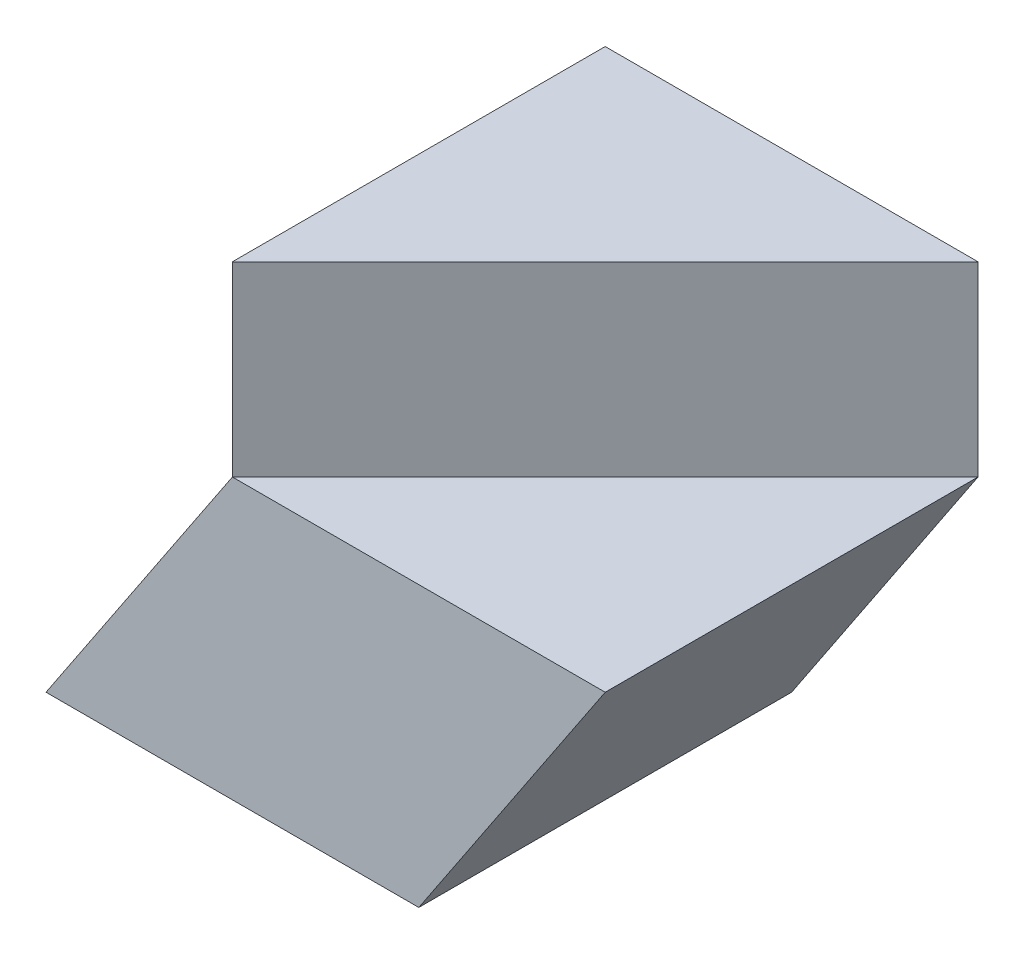
ISO-10303-21;
HEADER;
FILE_DESCRIPTION(('STEP AP214'),'2;1');
FILE_NAME('part.step','',(''),(''),'','','');
FILE_SCHEMA(('AUTOMOTIVE_DESIGN { 1 0 10303 214 1 1 1 1 }'));
ENDSEC;
DATA;
#1=APPLICATION_CONTEXT('core data for automotive mechanical design processes');
#2=APPLICATION_PROTOCOL_DEFINITION('international standard','automotive_design',2000,#1);
#3=PRODUCT_CONTEXT('',#1,'mechanical');
#4=PRODUCT('Part','Part','',(#3));
#5=PRODUCT_RELATED_PRODUCT_CATEGORY('part','',(#4));
#6=PRODUCT_DEFINITION_FORMATION('','',#4);
#7=PRODUCT_DEFINITION_CONTEXT('part definition',#1,'design');
#8=PRODUCT_DEFINITION('design','',#6,#7);
#9=PRODUCT_DEFINITION_SHAPE('','',#8);
#10=(LENGTH_UNIT() NAMED_UNIT(*) SI_UNIT(.MILLI.,.METRE.));
#11=(NAMED_UNIT(*) PLANE_ANGLE_UNIT() SI_UNIT($,.RADIAN.));
#12=(NAMED_UNIT(*) SI_UNIT($,.STERADIAN.) SOLID_ANGLE_UNIT());
#13=UNCERTAINTY_MEASURE_WITH_UNIT(LENGTH_MEASURE(1.E-05),#10,'distance_accuracy_value','');
#14=(GEOMETRIC_REPRESENTATION_CONTEXT(3) GLOBAL_UNCERTAINTY_ASSIGNED_CONTEXT((#13)) GLOBAL_UNIT_ASSIGNED_CONTEXT((#10,
#11,#12)) REPRESENTATION_CONTEXT('',''));
#15=CARTESIAN_POINT('',(0.,0.,0.));
#16=DIRECTION('',(0.,0.,1.));
#17=DIRECTION('',(1.,0.,0.));
#18=AXIS2_PLACEMENT_3D('',#15,#16,#17);
#19=CARTESIAN_POINT('',(0.,0.,40.));
#20=DIRECTION('',(0.,0.,1.));
#21=DIRECTION('',(1.,0.,0.));
#22=AXIS2_PLACEMENT_3D('',#19,#20,#21);
#23=PLANE('',#22);
#24=DIRECTION('',(-0.554700196225229,-0.832050294337844,0.));
#25=VECTOR('',#24,1.);
#26=CARTESIAN_POINT('',(27.6923076923077,-18.4615384615385,40.));
#27=LINE('',#26,#25);
#28=CARTESIAN_POINT('',(40.,0.,40.));
#29=VERTEX_POINT('',#28);
#30=CARTESIAN_POINT('',(20.,-30.,40.));
#31=VERTEX_POINT('',#30);
#32=EDGE_CURVE('E129',#29,#31,#27,.T.);
#33=ORIENTED_EDGE('',*,*,#32,.F.);
#34=DIRECTION('',(1.,0.,0.));
#35=VECTOR('',#34,1.);
#36=CARTESIAN_POINT('',(40.,0.,40.));
#37=LINE('',#36,#35);
#38=CARTESIAN_POINT('',(0.,0.,40.));
#39=VERTEX_POINT('',#38);
#40=EDGE_CURVE('E101',#39,#29,#37,.T.);
#41=ORIENTED_EDGE('',*,*,#40,.F.);
#42=DIRECTION('',(-0.554700196225229,-0.832050294337844,0.));
#43=VECTOR('',#42,1.);
#44=CARTESIAN_POINT('',(0.,0.,40.));
#45=LINE('',#44,#43);
#46=CARTESIAN_POINT('',(-20.,-30.,40.));
#47=VERTEX_POINT('',#46);
#48=EDGE_CURVE('E54',#39,#47,#45,.T.);
#49=ORIENTED_EDGE('',*,*,#48,.T.);
#50=DIRECTION('',(-1.,0.,0.));
#51=VECTOR('',#50,1.);
#52=CARTESIAN_POINT('',(0.,-30.,40.));
#53=LINE('',#52,#51);
#54=EDGE_CURVE('E83',#31,#47,#53,.T.);
#55=ORIENTED_EDGE('',*,*,#54,.F.);
#56=EDGE_LOOP('',(#33,#41,#49,#55));
#57=FACE_BOUND('',#56,.T.);
#58=ADVANCED_FACE('F37',(#57),#23,.T.);
#59=CARTESIAN_POINT('',(0.,-30.,40.));
#60=DIRECTION('',(0.,-1.,0.));
#61=DIRECTION('',(1.,0.,0.));
#62=AXIS2_PLACEMENT_3D('',#59,#60,#61);
#63=PLANE('',#62);
#64=DIRECTION('',(-1.,0.,0.));
#65=VECTOR('',#64,1.);
#66=CARTESIAN_POINT('',(0.,-30.,0.));
#67=LINE('',#66,#65);
#68=CARTESIAN_POINT('',(20.,-30.,0.));
#69=VERTEX_POINT('',#68);
#70=CARTESIAN_POINT('',(-20.,-30.,0.));
#71=VERTEX_POINT('',#70);
#72=EDGE_CURVE('E81',#69,#71,#67,.T.);
#73=ORIENTED_EDGE('',*,*,#72,.F.);
#74=DIRECTION('',(0.,0.,-1.));
#75=VECTOR('',#74,1.);
#76=CARTESIAN_POINT('',(20.,-30.,40.));
#77=LINE('',#76,#75);
#78=EDGE_CURVE('E11',#31,#69,#77,.T.);
#79=ORIENTED_EDGE('',*,*,#78,.F.);
#80=ORIENTED_EDGE('',*,*,#54,.T.);
#81=DIRECTION('',(0.,0.,-1.));
#82=VECTOR('',#81,1.);
#83=CARTESIAN_POINT('',(-20.,-30.,40.));
#84=LINE('',#83,#82);
#85=EDGE_CURVE('E79',#47,#71,#84,.T.);
#86=ORIENTED_EDGE('',*,*,#85,.T.);
#87=EDGE_LOOP('',(#73,#79,#80,#86));
#88=FACE_BOUND('',#87,.T.);
#89=ADVANCED_FACE('F39',(#88),#63,.T.);
#90=CARTESIAN_POINT('',(27.6923076923077,-18.4615384615385,40.));
#91=DIRECTION('',(0.832050294337844,-0.554700196225229,0.));
#92=DIRECTION('',(0.554700196225229,0.832050294337844,0.));
#93=AXIS2_PLACEMENT_3D('',#90,#91,#92);
#94=PLANE('',#93);
#95=DIRECTION('',(-0.554700196225229,-0.832050294337844,0.));
#96=VECTOR('',#95,1.);
#97=CARTESIAN_POINT('',(27.6923076923077,-18.4615384615385,0.));
#98=LINE('',#97,#96);
#99=CARTESIAN_POINT('',(40.,0.,0.));
#100=VERTEX_POINT('',#99);
#101=EDGE_CURVE('E95',#100,#69,#98,.T.);
#102=ORIENTED_EDGE('',*,*,#101,.F.);
#103=DIRECTION('',(0.,0.,-1.));
#104=VECTOR('',#103,1.);
#105=CARTESIAN_POINT('',(40.,0.,40.));
#106=LINE('',#105,#104);
#107=EDGE_CURVE('E46',#29,#100,#106,.T.);
#108=ORIENTED_EDGE('',*,*,#107,.F.);
#109=ORIENTED_EDGE('',*,*,#32,.T.);
#110=ORIENTED_EDGE('',*,*,#78,.T.);
#111=EDGE_LOOP('',(#102,#108,#109,#110));
#112=FACE_BOUND('',#111,.T.);
#113=ADVANCED_FACE('F128',(#112),#94,.T.);
#114=CARTESIAN_POINT('',(0.,20.,40.));
#115=DIRECTION('',(0.,1.,0.));
#116=DIRECTION('',(0.,0.,1.));
#117=AXIS2_PLACEMENT_3D('',#114,#115,#116);
#118=PLANE('',#117);
#119=DIRECTION('',(-0.707106781186548,0.,0.707106781186548));
#120=VECTOR('',#119,1.);
#121=CARTESIAN_POINT('',(0.,20.,40.));
#122=LINE('',#121,#120);
#123=CARTESIAN_POINT('',(40.,20.,0.));
#124=VERTEX_POINT('',#123);
#125=CARTESIAN_POINT('',(0.,20.,40.));
#126=VERTEX_POINT('',#125);
#127=EDGE_CURVE('E134',#124,#126,#122,.T.);
#128=ORIENTED_EDGE('',*,*,#127,.F.);
#129=DIRECTION('',(1.,0.,0.));
#130=VECTOR('',#129,1.);
#131=CARTESIAN_POINT('',(0.,20.,0.));
#132=LINE('',#131,#130);
#133=CARTESIAN_POINT('',(0.,20.,0.));
#134=VERTEX_POINT('',#133);
#135=EDGE_CURVE('E108',#134,#124,#132,.T.);
#136=ORIENTED_EDGE('',*,*,#135,.F.);
#137=DIRECTION('',(0.,0.,-1.));
#138=VECTOR('',#137,1.);
#139=CARTESIAN_POINT('',(0.,20.,40.));
#140=LINE('',#139,#138);
#141=EDGE_CURVE('E113',#126,#134,#140,.T.);
#142=ORIENTED_EDGE('',*,*,#141,.F.);
#143=EDGE_LOOP('',(#128,#136,#142));
#144=FACE_BOUND('',#143,.T.);
#145=ADVANCED_FACE('F146',(#144),#118,.T.);
#146=CARTESIAN_POINT('',(0.,0.,40.));
#147=DIRECTION('',(-1.,0.,0.));
#148=DIRECTION('',(0.,0.,1.));
#149=AXIS2_PLACEMENT_3D('',#146,#147,#148);
#150=PLANE('',#149);
#151=DIRECTION('',(0.,1.,0.));
#152=VECTOR('',#151,1.);
#153=CARTESIAN_POINT('',(0.,0.,0.));
#154=LINE('',#153,#152);
#155=CARTESIAN_POINT('',(0.,0.,0.));
#156=VERTEX_POINT('',#155);
#157=EDGE_CURVE('E90',#156,#134,#154,.T.);
#158=ORIENTED_EDGE('',*,*,#157,.F.);
#159=DIRECTION('',(0.,0.,-1.));
#160=VECTOR('',#159,1.);
#161=CARTESIAN_POINT('',(0.,0.,40.));
#162=LINE('',#161,#160);
#163=EDGE_CURVE('E73',#39,#156,#162,.T.);
#164=ORIENTED_EDGE('',*,*,#163,.F.);
#165=DIRECTION('',(0.,1.,0.));
#166=VECTOR('',#165,1.);
#167=CARTESIAN_POINT('',(0.,0.,40.));
#168=LINE('',#167,#166);
#169=EDGE_CURVE('E131',#39,#126,#168,.T.);
#170=ORIENTED_EDGE('',*,*,#169,.T.);
#171=ORIENTED_EDGE('',*,*,#141,.T.);
#172=EDGE_LOOP('',(#158,#164,#170,#171));
#173=FACE_BOUND('',#172,.T.);
#174=ADVANCED_FACE('F139',(#173),#150,.T.);
#175=CARTESIAN_POINT('',(0.,0.,40.));
#176=DIRECTION('',(0.832050294337844,-0.554700196225229,0.));
#177=DIRECTION('',(0.554700196225229,0.832050294337844,0.));
#178=AXIS2_PLACEMENT_3D('',#175,#176,#177);
#179=PLANE('',#178);
#180=DIRECTION('',(-0.554700196225229,-0.832050294337844,0.));
#181=VECTOR('',#180,1.);
#182=CARTESIAN_POINT('',(0.,0.,0.));
#183=LINE('',#182,#181);
#184=EDGE_CURVE('E85',#156,#71,#183,.T.);
#185=ORIENTED_EDGE('',*,*,#184,.T.);
#186=ORIENTED_EDGE('',*,*,#85,.F.);
#187=ORIENTED_EDGE('',*,*,#48,.F.);
#188=ORIENTED_EDGE('',*,*,#163,.T.);
#189=EDGE_LOOP('',(#185,#186,#187,#188));
#190=FACE_BOUND('',#189,.T.);
#191=ADVANCED_FACE('F86',(#190),#179,.F.);
#192=CARTESIAN_POINT('',(0.,0.,0.));
#193=DIRECTION('',(0.,0.,1.));
#194=DIRECTION('',(1.,0.,0.));
#195=AXIS2_PLACEMENT_3D('',#192,#193,#194);
#196=PLANE('',#195);
#197=ORIENTED_EDGE('',*,*,#72,.T.);
#198=ORIENTED_EDGE('',*,*,#184,.F.);
#199=ORIENTED_EDGE('',*,*,#157,.T.);
#200=ORIENTED_EDGE('',*,*,#135,.T.);
#201=DIRECTION('',(0.,1.,0.));
#202=VECTOR('',#201,1.);
#203=CARTESIAN_POINT('',(40.,0.,0.));
#204=LINE('',#203,#202);
#205=EDGE_CURVE('E98',#100,#124,#204,.T.);
#206=ORIENTED_EDGE('',*,*,#205,.F.);
#207=ORIENTED_EDGE('',*,*,#101,.T.);
#208=EDGE_LOOP('',(#197,#198,#199,#200,#206,#207));
#209=FACE_BOUND('',#208,.T.);
#210=ADVANCED_FACE('F92',(#209),#196,.F.);
#211=CARTESIAN_POINT('',(0.,0.,40.));
#212=DIRECTION('',(-0.707106781186548,0.,-0.707106781186548));
#213=DIRECTION('',(-0.707106781186548,0.,0.707106781186548));
#214=AXIS2_PLACEMENT_3D('',#211,#212,#213);
#215=PLANE('',#214);
#216=ORIENTED_EDGE('',*,*,#127,.T.);
#217=ORIENTED_EDGE('',*,*,#169,.F.);
#218=DIRECTION('',(-0.707106781186548,0.,0.707106781186548));
#219=VECTOR('',#218,1.);
#220=CARTESIAN_POINT('',(0.,0.,40.));
#221=LINE('',#220,#219);
#222=EDGE_CURVE('E96',#100,#39,#221,.T.);
#223=ORIENTED_EDGE('',*,*,#222,.F.);
#224=ORIENTED_EDGE('',*,*,#205,.T.);
#225=EDGE_LOOP('',(#216,#217,#223,#224));
#226=FACE_BOUND('',#225,.T.);
#227=ADVANCED_FACE('F141',(#226),#215,.F.);
#228=CARTESIAN_POINT('',(0.,0.,0.));
#229=DIRECTION('',(0.,1.,0.));
#230=DIRECTION('',(0.,0.,1.));
#231=AXIS2_PLACEMENT_3D('',#228,#229,#230);
#232=PLANE('',#231);
#233=ORIENTED_EDGE('',*,*,#40,.T.);
#234=ORIENTED_EDGE('',*,*,#107,.T.);
#235=ORIENTED_EDGE('',*,*,#222,.T.);
#236=EDGE_LOOP('',(#233,#234,#235));
#237=FACE_BOUND('',#236,.T.);
#238=ADVANCED_FACE('F118',(#237),#232,.T.);
#239=CLOSED_SHELL('',(#58,#89,#113,#145,#174,#191,#210,#227,#238));
#240=MANIFOLD_SOLID_BREP('B2',#239);
#241=ADVANCED_BREP_SHAPE_REPRESENTATION('',(#18,#240),#14);
#242=SHAPE_DEFINITION_REPRESENTATION(#9,#241);
ENDSEC;
END-ISO-10303-21;
